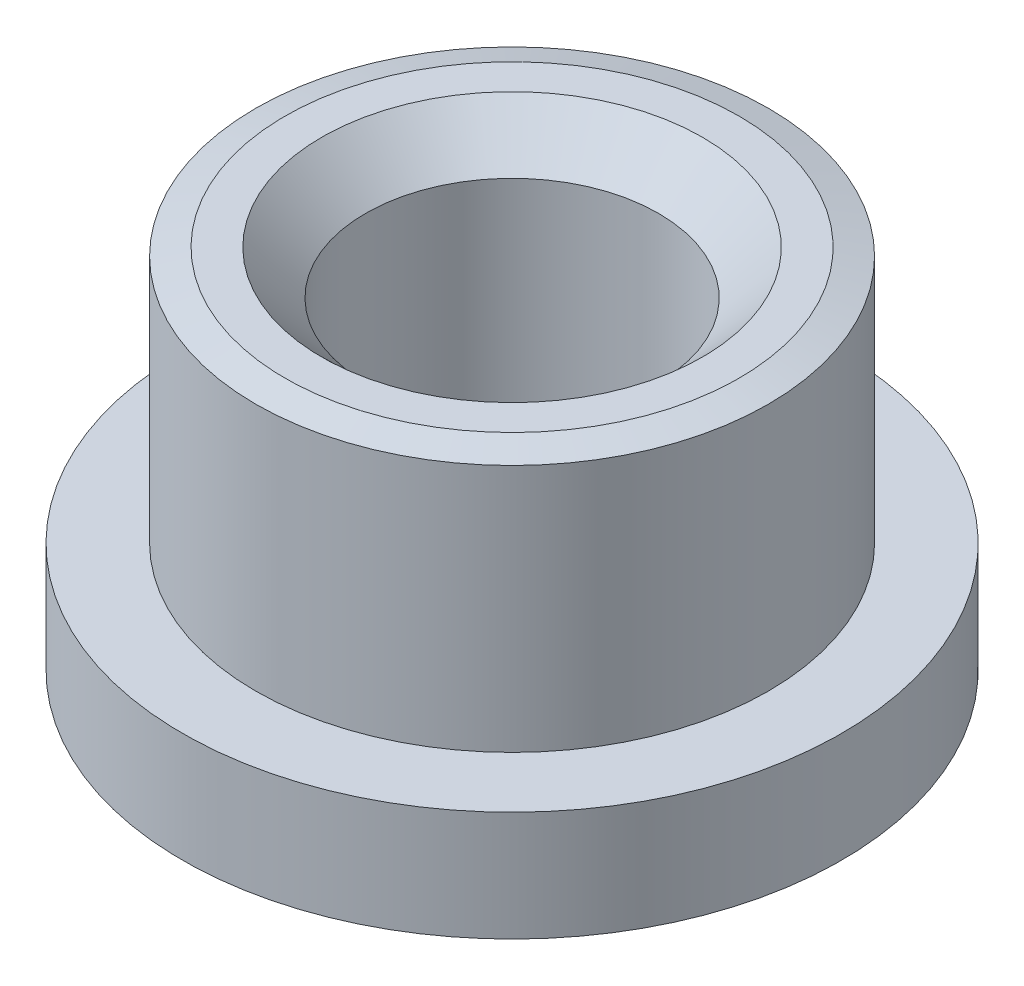
ISO-10303-21;
HEADER;
FILE_DESCRIPTION(('STEP AP214'),'2;1');
FILE_NAME('part.step','',(''),(''),'','','');
FILE_SCHEMA(('AUTOMOTIVE_DESIGN { 1 0 10303 214 1 1 1 1 }'));
ENDSEC;
DATA;
#1=APPLICATION_CONTEXT('core data for automotive mechanical design processes');
#2=APPLICATION_PROTOCOL_DEFINITION('international standard','automotive_design',2000,#1);
#3=PRODUCT_CONTEXT('',#1,'mechanical');
#4=PRODUCT('Part','Part','',(#3));
#5=PRODUCT_RELATED_PRODUCT_CATEGORY('part','',(#4));
#6=PRODUCT_DEFINITION_FORMATION('','',#4);
#7=PRODUCT_DEFINITION_CONTEXT('part definition',#1,'design');
#8=PRODUCT_DEFINITION('design','',#6,#7);
#9=PRODUCT_DEFINITION_SHAPE('','',#8);
#10=(LENGTH_UNIT() NAMED_UNIT(*) SI_UNIT(.MILLI.,.METRE.));
#11=(NAMED_UNIT(*) PLANE_ANGLE_UNIT() SI_UNIT($,.RADIAN.));
#12=(NAMED_UNIT(*) SI_UNIT($,.STERADIAN.) SOLID_ANGLE_UNIT());
#13=UNCERTAINTY_MEASURE_WITH_UNIT(LENGTH_MEASURE(1.E-05),#10,'distance_accuracy_value','');
#14=(GEOMETRIC_REPRESENTATION_CONTEXT(3) GLOBAL_UNCERTAINTY_ASSIGNED_CONTEXT((#13)) GLOBAL_UNIT_ASSIGNED_CONTEXT((#10,
#11,#12)) REPRESENTATION_CONTEXT('',''));
#15=CARTESIAN_POINT('',(0.,0.,0.));
#16=DIRECTION('',(0.,0.,1.));
#17=DIRECTION('',(1.,0.,0.));
#18=AXIS2_PLACEMENT_3D('',#15,#16,#17);
#19=CARTESIAN_POINT('',(0.,-11.687612647578,0.));
#20=DIRECTION('',(0.,-1.,0.));
#21=DIRECTION('',(0.,0.,-1.));
#22=AXIS2_PLACEMENT_3D('',#19,#20,#21);
#23=CYLINDRICAL_SURFACE('',#22,4.);
#24=CARTESIAN_POINT('',(0.,8.8,0.));
#25=DIRECTION('',(0.,-1.,0.));
#26=DIRECTION('',(0.,0.,-1.));
#27=AXIS2_PLACEMENT_3D('',#24,#25,#26);
#28=CIRCLE('',#27,4.);
#29=CARTESIAN_POINT('',(0.,8.8,-4.));
#30=VERTEX_POINT('',#29);
#31=EDGE_CURVE('E10',#30,#30,#28,.F.);
#32=ORIENTED_EDGE('',*,*,#31,.T.);
#33=EDGE_LOOP('',(#32));
#34=FACE_BOUND('',#33,.T.);
#35=CARTESIAN_POINT('',(0.,0.,0.));
#36=DIRECTION('',(0.,-1.,0.));
#37=DIRECTION('',(0.,0.,-1.));
#38=AXIS2_PLACEMENT_3D('',#35,#36,#37);
#39=CIRCLE('',#38,4.);
#40=CARTESIAN_POINT('',(0.,0.,-4.));
#41=VERTEX_POINT('',#40);
#42=EDGE_CURVE('E54',#41,#41,#39,.T.);
#43=ORIENTED_EDGE('',*,*,#42,.T.);
#44=EDGE_LOOP('',(#43));
#45=FACE_BOUND('',#44,.T.);
#46=ADVANCED_FACE('F33',(#34,#45),#23,.F.);
#47=CARTESIAN_POINT('',(-4.,0.,0.));
#48=DIRECTION('',(0.,1.,0.));
#49=DIRECTION('',(0.,0.,1.));
#50=AXIS2_PLACEMENT_3D('',#47,#48,#49);
#51=PLANE('',#50);
#52=ORIENTED_EDGE('',*,*,#42,.F.);
#53=EDGE_LOOP('',(#52));
#54=FACE_BOUND('',#53,.T.);
#55=CARTESIAN_POINT('',(0.,0.,0.));
#56=DIRECTION('',(0.,-1.,0.));
#57=DIRECTION('',(0.,0.,-1.));
#58=AXIS2_PLACEMENT_3D('',#55,#56,#57);
#59=CIRCLE('',#58,9.);
#60=CARTESIAN_POINT('',(0.,0.,-9.));
#61=VERTEX_POINT('',#60);
#62=EDGE_CURVE('E57',#61,#61,#59,.T.);
#63=ORIENTED_EDGE('',*,*,#62,.T.);
#64=EDGE_LOOP('',(#63));
#65=FACE_BOUND('',#64,.T.);
#66=ADVANCED_FACE('F84',(#54,#65),#51,.F.);
#67=CARTESIAN_POINT('',(0.,-11.687612647578,0.));
#68=DIRECTION('',(0.,-1.,0.));
#69=DIRECTION('',(0.,0.,-1.));
#70=AXIS2_PLACEMENT_3D('',#67,#68,#69);
#71=CYLINDRICAL_SURFACE('',#70,9.);
#72=ORIENTED_EDGE('',*,*,#62,.F.);
#73=EDGE_LOOP('',(#72));
#74=FACE_BOUND('',#73,.T.);
#75=CARTESIAN_POINT('',(0.,3.,0.));
#76=DIRECTION('',(0.,-1.,0.));
#77=DIRECTION('',(0.,0.,-1.));
#78=AXIS2_PLACEMENT_3D('',#75,#76,#77);
#79=CIRCLE('',#78,9.);
#80=CARTESIAN_POINT('',(0.,3.,-9.));
#81=VERTEX_POINT('',#80);
#82=EDGE_CURVE('E60',#81,#81,#79,.T.);
#83=ORIENTED_EDGE('',*,*,#82,.T.);
#84=EDGE_LOOP('',(#83));
#85=FACE_BOUND('',#84,.T.);
#86=ADVANCED_FACE('F80',(#74,#85),#71,.T.);
#87=CARTESIAN_POINT('',(-9.,3.,0.));
#88=DIRECTION('',(0.,-1.,0.));
#89=DIRECTION('',(0.,0.,-1.));
#90=AXIS2_PLACEMENT_3D('',#87,#88,#89);
#91=PLANE('',#90);
#92=ORIENTED_EDGE('',*,*,#82,.F.);
#93=EDGE_LOOP('',(#92));
#94=FACE_BOUND('',#93,.T.);
#95=CARTESIAN_POINT('',(0.,3.,0.));
#96=DIRECTION('',(0.,-1.,0.));
#97=DIRECTION('',(0.,0.,-1.));
#98=AXIS2_PLACEMENT_3D('',#95,#96,#97);
#99=CIRCLE('',#98,7.);
#100=CARTESIAN_POINT('',(0.,3.,-7.));
#101=VERTEX_POINT('',#100);
#102=EDGE_CURVE('E63',#101,#101,#99,.T.);
#103=ORIENTED_EDGE('',*,*,#102,.T.);
#104=EDGE_LOOP('',(#103));
#105=FACE_BOUND('',#104,.T.);
#106=ADVANCED_FACE('F67',(#94,#105),#91,.F.);
#107=CARTESIAN_POINT('',(0.,-11.687612647578,0.));
#108=DIRECTION('',(0.,-1.,0.));
#109=DIRECTION('',(0.,0.,-1.));
#110=AXIS2_PLACEMENT_3D('',#107,#108,#109);
#111=CYLINDRICAL_SURFACE('',#110,7.);
#112=CARTESIAN_POINT('',(0.,9.7856406460551,0.));
#113=DIRECTION('',(0.,-1.,0.));
#114=DIRECTION('',(0.,0.,-1.));
#115=AXIS2_PLACEMENT_3D('',#112,#113,#114);
#116=CIRCLE('',#115,7.);
#117=CARTESIAN_POINT('',(0.,9.7856406460551,-7.));
#118=VERTEX_POINT('',#117);
#119=EDGE_CURVE('E49',#118,#118,#116,.T.);
#120=ORIENTED_EDGE('',*,*,#119,.T.);
#121=EDGE_LOOP('',(#120));
#122=FACE_BOUND('',#121,.T.);
#123=ORIENTED_EDGE('',*,*,#102,.F.);
#124=EDGE_LOOP('',(#123));
#125=FACE_BOUND('',#124,.T.);
#126=ADVANCED_FACE('F69',(#122,#125),#111,.T.);
#127=CARTESIAN_POINT('',(-7.,10.,0.));
#128=DIRECTION('',(0.,-1.,0.));
#129=DIRECTION('',(0.,0.,-1.));
#130=AXIS2_PLACEMENT_3D('',#127,#128,#129);
#131=PLANE('',#130);
#132=CARTESIAN_POINT('',(0.,10.,0.));
#133=DIRECTION('',(0.,-1.,0.));
#134=DIRECTION('',(0.,0.,-1.));
#135=AXIS2_PLACEMENT_3D('',#132,#133,#134);
#136=CIRCLE('',#135,5.2);
#137=CARTESIAN_POINT('',(0.,10.,-5.2));
#138=VERTEX_POINT('',#137);
#139=EDGE_CURVE('E41',#138,#138,#136,.T.);
#140=ORIENTED_EDGE('',*,*,#139,.T.);
#141=EDGE_LOOP('',(#140));
#142=FACE_BOUND('',#141,.T.);
#143=CARTESIAN_POINT('',(0.,10.,0.));
#144=DIRECTION('',(0.,-1.,0.));
#145=DIRECTION('',(0.,0.,-1.));
#146=AXIS2_PLACEMENT_3D('',#143,#144,#145);
#147=CIRCLE('',#146,6.2);
#148=CARTESIAN_POINT('',(0.,10.,-6.2));
#149=VERTEX_POINT('',#148);
#150=EDGE_CURVE('E45',#149,#149,#147,.F.);
#151=ORIENTED_EDGE('',*,*,#150,.T.);
#152=EDGE_LOOP('',(#151));
#153=FACE_BOUND('',#152,.T.);
#154=ADVANCED_FACE('F71',(#142,#153),#131,.F.);
#155=CARTESIAN_POINT('',(0.,9.7856406460551,0.));
#156=DIRECTION('',(0.,-1.,0.));
#157=DIRECTION('',(0.,0.,-1.));
#158=AXIS2_PLACEMENT_3D('',#155,#156,#157);
#159=CONICAL_SURFACE('',#158,7.,1.30899693899575);
#160=ORIENTED_EDGE('',*,*,#150,.F.);
#161=EDGE_LOOP('',(#160));
#162=FACE_BOUND('',#161,.T.);
#163=ORIENTED_EDGE('',*,*,#119,.F.);
#164=EDGE_LOOP('',(#163));
#165=FACE_BOUND('',#164,.T.);
#166=ADVANCED_FACE('F78',(#162,#165),#159,.T.);
#167=CARTESIAN_POINT('',(0.,10.,0.));
#168=DIRECTION('',(0.,1.,0.));
#169=DIRECTION('',(0.,0.,1.));
#170=AXIS2_PLACEMENT_3D('',#167,#168,#169);
#171=CONICAL_SURFACE('',#170,5.2,0.785398163397447);
#172=ORIENTED_EDGE('',*,*,#31,.F.);
#173=EDGE_LOOP('',(#172));
#174=FACE_BOUND('',#173,.T.);
#175=ORIENTED_EDGE('',*,*,#139,.F.);
#176=EDGE_LOOP('',(#175));
#177=FACE_BOUND('',#176,.T.);
#178=ADVANCED_FACE('F36',(#174,#177),#171,.F.);
#179=CLOSED_SHELL('',(#46,#66,#86,#106,#126,#154,#166,#178));
#180=MANIFOLD_SOLID_BREP('B2',#179);
#181=ADVANCED_BREP_SHAPE_REPRESENTATION('',(#18,#180),#14);
#182=SHAPE_DEFINITION_REPRESENTATION(#9,#181);
ENDSEC;
END-ISO-10303-21;
